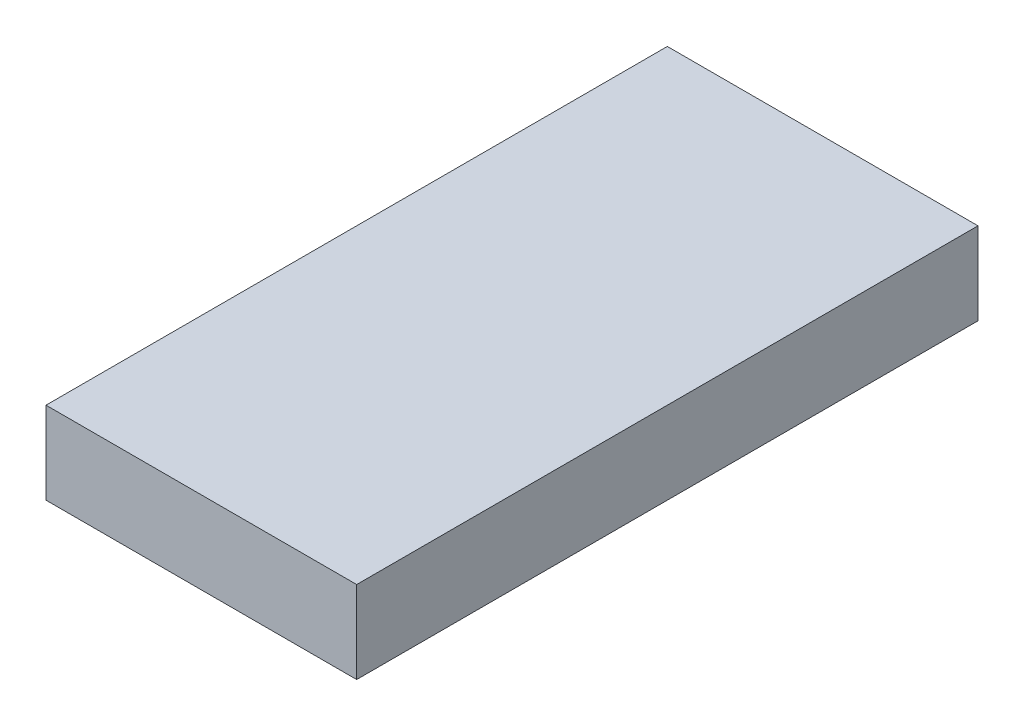
ISO-10303-21;
HEADER;
FILE_DESCRIPTION(('STEP AP214'),'2;1');
FILE_NAME('part.step','',(''),(''),'','','');
FILE_SCHEMA(('AUTOMOTIVE_DESIGN { 1 0 10303 214 1 1 1 1 }'));
ENDSEC;
DATA;
#1=APPLICATION_CONTEXT('core data for automotive mechanical design processes');
#2=APPLICATION_PROTOCOL_DEFINITION('international standard','automotive_design',2000,#1);
#3=PRODUCT_CONTEXT('',#1,'mechanical');
#4=PRODUCT('Part','Part','',(#3));
#5=PRODUCT_RELATED_PRODUCT_CATEGORY('part','',(#4));
#6=PRODUCT_DEFINITION_FORMATION('','',#4);
#7=PRODUCT_DEFINITION_CONTEXT('part definition',#1,'design');
#8=PRODUCT_DEFINITION('design','',#6,#7);
#9=PRODUCT_DEFINITION_SHAPE('','',#8);
#10=(LENGTH_UNIT() NAMED_UNIT(*) SI_UNIT(.MILLI.,.METRE.));
#11=(NAMED_UNIT(*) PLANE_ANGLE_UNIT() SI_UNIT($,.RADIAN.));
#12=(NAMED_UNIT(*) SI_UNIT($,.STERADIAN.) SOLID_ANGLE_UNIT());
#13=UNCERTAINTY_MEASURE_WITH_UNIT(LENGTH_MEASURE(1.E-05),#10,'distance_accuracy_value','');
#14=(GEOMETRIC_REPRESENTATION_CONTEXT(3) GLOBAL_UNCERTAINTY_ASSIGNED_CONTEXT((#13)) GLOBAL_UNIT_ASSIGNED_CONTEXT((#10,
#11,#12)) REPRESENTATION_CONTEXT('',''));
#15=CARTESIAN_POINT('',(0.,0.,0.));
#16=DIRECTION('',(0.,0.,1.));
#17=DIRECTION('',(1.,0.,0.));
#18=AXIS2_PLACEMENT_3D('',#15,#16,#17);
#19=CARTESIAN_POINT('',(377.5,100.,377.5));
#20=DIRECTION('',(-1.,0.,0.));
#21=DIRECTION('',(0.,0.,1.));
#22=AXIS2_PLACEMENT_3D('',#19,#20,#21);
#23=PLANE('',#22);
#24=DIRECTION('',(0.,0.,-1.));
#25=VECTOR('',#24,1.);
#26=CARTESIAN_POINT('',(377.5,0.,377.5));
#27=LINE('',#26,#25);
#28=CARTESIAN_POINT('',(377.5,0.,377.5));
#29=VERTEX_POINT('',#28);
#30=CARTESIAN_POINT('',(377.5,0.,-377.5));
#31=VERTEX_POINT('',#30);
#32=EDGE_CURVE('E81',#29,#31,#27,.T.);
#33=ORIENTED_EDGE('',*,*,#32,.T.);
#34=DIRECTION('',(0.,-1.,0.));
#35=VECTOR('',#34,1.);
#36=CARTESIAN_POINT('',(377.5,100.,-377.5));
#37=LINE('',#36,#35);
#38=CARTESIAN_POINT('',(377.5,100.,-377.5));
#39=VERTEX_POINT('',#38);
#40=EDGE_CURVE('E37',#39,#31,#37,.T.);
#41=ORIENTED_EDGE('',*,*,#40,.F.);
#42=DIRECTION('',(0.,0.,-1.));
#43=VECTOR('',#42,1.);
#44=CARTESIAN_POINT('',(377.5,100.,377.5));
#45=LINE('',#44,#43);
#46=CARTESIAN_POINT('',(377.5,100.,377.5));
#47=VERTEX_POINT('',#46);
#48=EDGE_CURVE('E75',#47,#39,#45,.T.);
#49=ORIENTED_EDGE('',*,*,#48,.F.);
#50=DIRECTION('',(0.,-1.,0.));
#51=VECTOR('',#50,1.);
#52=CARTESIAN_POINT('',(377.5,100.,377.5));
#53=LINE('',#52,#51);
#54=EDGE_CURVE('E69',#47,#29,#53,.T.);
#55=ORIENTED_EDGE('',*,*,#54,.T.);
#56=EDGE_LOOP('',(#33,#41,#49,#55));
#57=FACE_BOUND('',#56,.T.);
#58=ADVANCED_FACE('F30',(#57),#23,.F.);
#59=CARTESIAN_POINT('',(-377.5,100.,-377.5));
#60=DIRECTION('',(0.,0.,1.));
#61=DIRECTION('',(1.,0.,0.));
#62=AXIS2_PLACEMENT_3D('',#59,#60,#61);
#63=PLANE('',#62);
#64=DIRECTION('',(-1.,0.,0.));
#65=VECTOR('',#64,1.);
#66=CARTESIAN_POINT('',(-377.5,0.,-377.5));
#67=LINE('',#66,#65);
#68=CARTESIAN_POINT('',(0.,0.,-377.5));
#69=VERTEX_POINT('',#68);
#70=EDGE_CURVE('E76',#31,#69,#67,.T.);
#71=ORIENTED_EDGE('',*,*,#70,.T.);
#72=DIRECTION('',(0.,1.,0.));
#73=VECTOR('',#72,1.);
#74=CARTESIAN_POINT('',(0.,100.,-377.5));
#75=LINE('',#74,#73);
#76=CARTESIAN_POINT('',(0.,100.,-377.5));
#77=VERTEX_POINT('',#76);
#78=EDGE_CURVE('E43',#69,#77,#75,.T.);
#79=ORIENTED_EDGE('',*,*,#78,.T.);
#80=DIRECTION('',(-1.,0.,0.));
#81=VECTOR('',#80,1.);
#82=CARTESIAN_POINT('',(-377.5,100.,-377.5));
#83=LINE('',#82,#81);
#84=EDGE_CURVE('E94',#39,#77,#83,.T.);
#85=ORIENTED_EDGE('',*,*,#84,.F.);
#86=ORIENTED_EDGE('',*,*,#40,.T.);
#87=EDGE_LOOP('',(#71,#79,#85,#86));
#88=FACE_BOUND('',#87,.T.);
#89=ADVANCED_FACE('F92',(#88),#63,.F.);
#90=CARTESIAN_POINT('',(-377.5,100.,377.5));
#91=DIRECTION('',(0.,0.,-1.));
#92=DIRECTION('',(-1.,0.,0.));
#93=AXIS2_PLACEMENT_3D('',#90,#91,#92);
#94=PLANE('',#93);
#95=DIRECTION('',(1.,0.,0.));
#96=VECTOR('',#95,1.);
#97=CARTESIAN_POINT('',(-377.5,100.,377.5));
#98=LINE('',#97,#96);
#99=CARTESIAN_POINT('',(0.,100.,377.5));
#100=VERTEX_POINT('',#99);
#101=EDGE_CURVE('E52',#100,#47,#98,.T.);
#102=ORIENTED_EDGE('',*,*,#101,.F.);
#103=DIRECTION('',(0.,-1.,0.));
#104=VECTOR('',#103,1.);
#105=CARTESIAN_POINT('',(0.,100.,377.5));
#106=LINE('',#105,#104);
#107=CARTESIAN_POINT('',(0.,0.,377.5));
#108=VERTEX_POINT('',#107);
#109=EDGE_CURVE('E72',#100,#108,#106,.T.);
#110=ORIENTED_EDGE('',*,*,#109,.T.);
#111=DIRECTION('',(1.,0.,0.));
#112=VECTOR('',#111,1.);
#113=CARTESIAN_POINT('',(-377.5,0.,377.5));
#114=LINE('',#113,#112);
#115=EDGE_CURVE('E66',#108,#29,#114,.T.);
#116=ORIENTED_EDGE('',*,*,#115,.T.);
#117=ORIENTED_EDGE('',*,*,#54,.F.);
#118=EDGE_LOOP('',(#102,#110,#116,#117));
#119=FACE_BOUND('',#118,.T.);
#120=ADVANCED_FACE('F68',(#119),#94,.F.);
#121=CARTESIAN_POINT('',(377.5,100.,-377.5));
#122=DIRECTION('',(0.,-1.,0.));
#123=DIRECTION('',(0.,0.,-1.));
#124=AXIS2_PLACEMENT_3D('',#121,#122,#123);
#125=PLANE('',#124);
#126=ORIENTED_EDGE('',*,*,#84,.T.);
#127=DIRECTION('',(0.,0.,-1.));
#128=VECTOR('',#127,1.);
#129=CARTESIAN_POINT('',(0.,100.,423.824483775811));
#130=LINE('',#129,#128);
#131=EDGE_CURVE('E100',#100,#77,#130,.T.);
#132=ORIENTED_EDGE('',*,*,#131,.F.);
#133=ORIENTED_EDGE('',*,*,#101,.T.);
#134=ORIENTED_EDGE('',*,*,#48,.T.);
#135=EDGE_LOOP('',(#126,#132,#133,#134));
#136=FACE_BOUND('',#135,.T.);
#137=ADVANCED_FACE('F96',(#136),#125,.F.);
#138=CARTESIAN_POINT('',(377.5,0.,-377.5));
#139=DIRECTION('',(0.,-1.,0.));
#140=DIRECTION('',(0.,0.,-1.));
#141=AXIS2_PLACEMENT_3D('',#138,#139,#140);
#142=PLANE('',#141);
#143=DIRECTION('',(0.,0.,1.));
#144=VECTOR('',#143,1.);
#145=CARTESIAN_POINT('',(0.,0.,-377.5));
#146=LINE('',#145,#144);
#147=EDGE_CURVE('E11',#69,#108,#146,.T.);
#148=ORIENTED_EDGE('',*,*,#147,.F.);
#149=ORIENTED_EDGE('',*,*,#70,.F.);
#150=ORIENTED_EDGE('',*,*,#32,.F.);
#151=ORIENTED_EDGE('',*,*,#115,.F.);
#152=EDGE_LOOP('',(#148,#149,#150,#151));
#153=FACE_BOUND('',#152,.T.);
#154=ADVANCED_FACE('F83',(#153),#142,.T.);
#155=CARTESIAN_POINT('',(0.,0.,423.824483775811));
#156=DIRECTION('',(1.,0.,0.));
#157=DIRECTION('',(0.,0.,-1.));
#158=AXIS2_PLACEMENT_3D('',#155,#156,#157);
#159=PLANE('',#158);
#160=ORIENTED_EDGE('',*,*,#147,.T.);
#161=ORIENTED_EDGE('',*,*,#109,.F.);
#162=ORIENTED_EDGE('',*,*,#131,.T.);
#163=ORIENTED_EDGE('',*,*,#78,.F.);
#164=EDGE_LOOP('',(#160,#161,#162,#163));
#165=FACE_BOUND('',#164,.T.);
#166=ADVANCED_FACE('F101',(#165),#159,.F.);
#167=CLOSED_SHELL('',(#58,#89,#120,#137,#154,#166));
#168=MANIFOLD_SOLID_BREP('B2',#167);
#169=ADVANCED_BREP_SHAPE_REPRESENTATION('',(#18,#168),#14);
#170=SHAPE_DEFINITION_REPRESENTATION(#9,#169);
ENDSEC;
END-ISO-10303-21;
